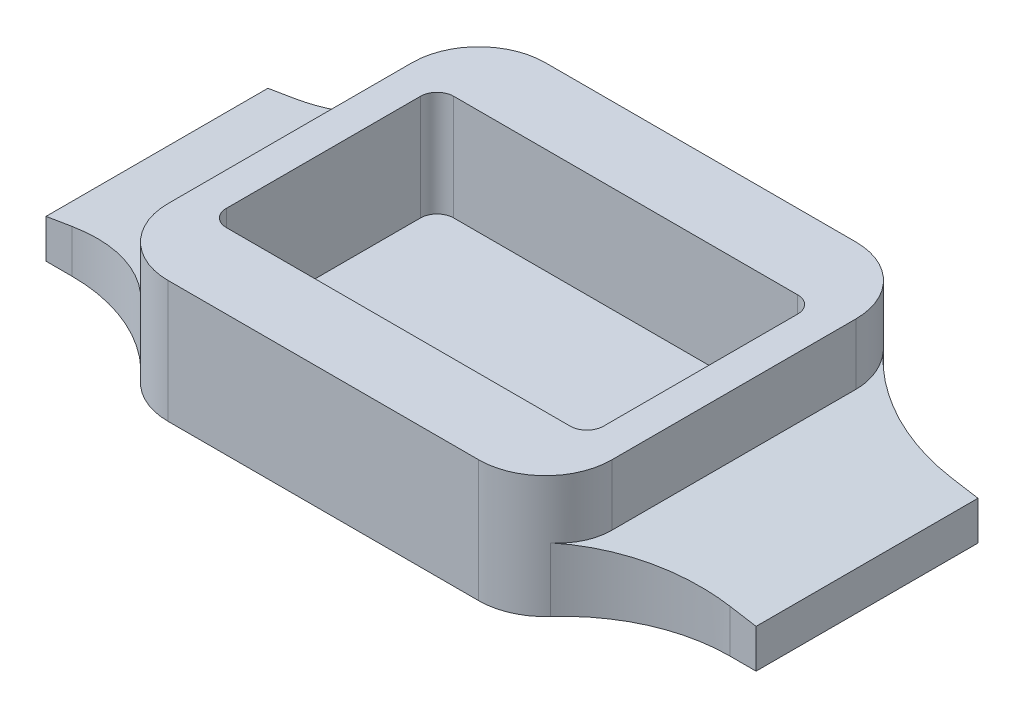
ISO-10303-21;
HEADER;
FILE_DESCRIPTION(('STEP AP214'),'2;1');
FILE_NAME('part.step','',(''),(''),'','','');
FILE_SCHEMA(('AUTOMOTIVE_DESIGN { 1 0 10303 214 1 1 1 1 }'));
ENDSEC;
DATA;
#1=APPLICATION_CONTEXT('core data for automotive mechanical design processes');
#2=APPLICATION_PROTOCOL_DEFINITION('international standard','automotive_design',2000,#1);
#3=PRODUCT_CONTEXT('',#1,'mechanical');
#4=PRODUCT('Part','Part','',(#3));
#5=PRODUCT_RELATED_PRODUCT_CATEGORY('part','',(#4));
#6=PRODUCT_DEFINITION_FORMATION('','',#4);
#7=PRODUCT_DEFINITION_CONTEXT('part definition',#1,'design');
#8=PRODUCT_DEFINITION('design','',#6,#7);
#9=PRODUCT_DEFINITION_SHAPE('','',#8);
#10=(LENGTH_UNIT() NAMED_UNIT(*) SI_UNIT(.MILLI.,.METRE.));
#11=(NAMED_UNIT(*) PLANE_ANGLE_UNIT() SI_UNIT($,.RADIAN.));
#12=(NAMED_UNIT(*) SI_UNIT($,.STERADIAN.) SOLID_ANGLE_UNIT());
#13=UNCERTAINTY_MEASURE_WITH_UNIT(LENGTH_MEASURE(1.E-05),#10,'distance_accuracy_value','');
#14=(GEOMETRIC_REPRESENTATION_CONTEXT(3) GLOBAL_UNCERTAINTY_ASSIGNED_CONTEXT((#13)) GLOBAL_UNIT_ASSIGNED_CONTEXT((#10,
#11,#12)) REPRESENTATION_CONTEXT('',''));
#15=CARTESIAN_POINT('',(0.,0.,0.));
#16=DIRECTION('',(0.,0.,1.));
#17=DIRECTION('',(1.,0.,0.));
#18=AXIS2_PLACEMENT_3D('',#15,#16,#17);
#19=CARTESIAN_POINT('',(0.,11.,0.));
#20=DIRECTION('',(1.,0.,0.));
#21=DIRECTION('',(0.,0.,-1.));
#22=AXIS2_PLACEMENT_3D('',#19,#20,#21);
#23=PLANE('',#22);
#24=DIRECTION('',(0.,-1.,0.));
#25=VECTOR('',#24,1.);
#26=CARTESIAN_POINT('',(0.,11.,-28.));
#27=LINE('',#26,#25);
#28=CARTESIAN_POINT('',(0.,11.,-28.));
#29=VERTEX_POINT('',#28);
#30=CARTESIAN_POINT('',(0.,5.5,-28.));
#31=VERTEX_POINT('',#30);
#32=EDGE_CURVE('E466',#29,#31,#27,.T.);
#33=ORIENTED_EDGE('',*,*,#32,.T.);
#34=DIRECTION('',(0.,0.,1.));
#35=VECTOR('',#34,1.);
#36=CARTESIAN_POINT('',(0.,5.5,-27.));
#37=LINE('',#36,#35);
#38=CARTESIAN_POINT('',(0.,5.5,-6.));
#39=VERTEX_POINT('',#38);
#40=EDGE_CURVE('E75',#31,#39,#37,.T.);
#41=ORIENTED_EDGE('',*,*,#40,.T.);
#42=DIRECTION('',(0.,-1.,0.));
#43=VECTOR('',#42,1.);
#44=CARTESIAN_POINT('',(0.,11.,-6.));
#45=LINE('',#44,#43);
#46=CARTESIAN_POINT('',(0.,11.,-6.));
#47=VERTEX_POINT('',#46);
#48=EDGE_CURVE('E463',#39,#47,#45,.F.);
#49=ORIENTED_EDGE('',*,*,#48,.T.);
#50=DIRECTION('',(0.,0.,1.));
#51=VECTOR('',#50,1.);
#52=CARTESIAN_POINT('',(0.,11.,0.));
#53=LINE('',#52,#51);
#54=EDGE_CURVE('E350',#29,#47,#53,.T.);
#55=ORIENTED_EDGE('',*,*,#54,.F.);
#56=EDGE_LOOP('',(#33,#41,#49,#55));
#57=FACE_BOUND('',#56,.T.);
#58=ADVANCED_FACE('F51',(#57),#23,.F.);
#59=CARTESIAN_POINT('',(0.,11.,0.));
#60=DIRECTION('',(0.,0.,-1.));
#61=DIRECTION('',(-1.,0.,0.));
#62=AXIS2_PLACEMENT_3D('',#59,#60,#61);
#63=PLANE('',#62);
#64=DIRECTION('',(1.,0.,0.));
#65=VECTOR('',#64,1.);
#66=CARTESIAN_POINT('',(0.,0.,0.));
#67=LINE('',#66,#65);
#68=CARTESIAN_POINT('',(6.,0.,0.));
#69=VERTEX_POINT('',#68);
#70=CARTESIAN_POINT('',(34.,0.,0.));
#71=VERTEX_POINT('',#70);
#72=EDGE_CURVE('E342',#69,#71,#67,.T.);
#73=ORIENTED_EDGE('',*,*,#72,.T.);
#74=DIRECTION('',(0.,-1.,0.));
#75=VECTOR('',#74,1.);
#76=CARTESIAN_POINT('',(34.,11.,0.));
#77=LINE('',#76,#75);
#78=CARTESIAN_POINT('',(34.,11.,0.));
#79=VERTEX_POINT('',#78);
#80=EDGE_CURVE('E473',#71,#79,#77,.F.);
#81=ORIENTED_EDGE('',*,*,#80,.T.);
#82=DIRECTION('',(1.,0.,0.));
#83=VECTOR('',#82,1.);
#84=CARTESIAN_POINT('',(0.,11.,0.));
#85=LINE('',#84,#83);
#86=CARTESIAN_POINT('',(6.,11.,0.));
#87=VERTEX_POINT('',#86);
#88=EDGE_CURVE('E354',#87,#79,#85,.T.);
#89=ORIENTED_EDGE('',*,*,#88,.F.);
#90=DIRECTION('',(0.,-1.,0.));
#91=VECTOR('',#90,1.);
#92=CARTESIAN_POINT('',(6.,11.,0.));
#93=LINE('',#92,#91);
#94=EDGE_CURVE('E469',#87,#69,#93,.T.);
#95=ORIENTED_EDGE('',*,*,#94,.T.);
#96=EDGE_LOOP('',(#73,#81,#89,#95));
#97=FACE_BOUND('',#96,.T.);
#98=ADVANCED_FACE('F577',(#97),#63,.F.);
#99=CARTESIAN_POINT('',(40.,11.,0.));
#100=DIRECTION('',(-1.,0.,0.));
#101=DIRECTION('',(0.,0.,1.));
#102=AXIS2_PLACEMENT_3D('',#99,#100,#101);
#103=PLANE('',#102);
#104=DIRECTION('',(0.,-1.,0.));
#105=VECTOR('',#104,1.);
#106=CARTESIAN_POINT('',(40.,11.,-6.));
#107=LINE('',#106,#105);
#108=CARTESIAN_POINT('',(40.,11.,-6.));
#109=VERTEX_POINT('',#108);
#110=CARTESIAN_POINT('',(40.,5.5,-6.));
#111=VERTEX_POINT('',#110);
#112=EDGE_CURVE('E445',#109,#111,#107,.T.);
#113=ORIENTED_EDGE('',*,*,#112,.T.);
#114=DIRECTION('',(0.,0.,1.));
#115=VECTOR('',#114,1.);
#116=CARTESIAN_POINT('',(40.,5.5,-27.));
#117=LINE('',#116,#115);
#118=CARTESIAN_POINT('',(40.,5.5,-28.));
#119=VERTEX_POINT('',#118);
#120=EDGE_CURVE('E67',#119,#111,#117,.T.);
#121=ORIENTED_EDGE('',*,*,#120,.F.);
#122=DIRECTION('',(0.,-1.,0.));
#123=VECTOR('',#122,1.);
#124=CARTESIAN_POINT('',(40.,11.,-28.));
#125=LINE('',#124,#123);
#126=CARTESIAN_POINT('',(40.,11.,-28.));
#127=VERTEX_POINT('',#126);
#128=EDGE_CURVE('E448',#119,#127,#125,.F.);
#129=ORIENTED_EDGE('',*,*,#128,.T.);
#130=DIRECTION('',(0.,0.,-1.));
#131=VECTOR('',#130,1.);
#132=CARTESIAN_POINT('',(40.,11.,0.));
#133=LINE('',#132,#131);
#134=EDGE_CURVE('E359',#109,#127,#133,.T.);
#135=ORIENTED_EDGE('',*,*,#134,.F.);
#136=EDGE_LOOP('',(#113,#121,#129,#135));
#137=FACE_BOUND('',#136,.T.);
#138=ADVANCED_FACE('F623',(#137),#103,.F.);
#139=CARTESIAN_POINT('',(0.,11.,-34.));
#140=DIRECTION('',(0.,0.,1.));
#141=DIRECTION('',(1.,0.,0.));
#142=AXIS2_PLACEMENT_3D('',#139,#140,#141);
#143=PLANE('',#142);
#144=DIRECTION('',(-1.,0.,0.));
#145=VECTOR('',#144,1.);
#146=CARTESIAN_POINT('',(0.,11.,-34.));
#147=LINE('',#146,#145);
#148=CARTESIAN_POINT('',(34.,11.,-34.));
#149=VERTEX_POINT('',#148);
#150=CARTESIAN_POINT('',(6.,11.,-34.));
#151=VERTEX_POINT('',#150);
#152=EDGE_CURVE('E363',#149,#151,#147,.T.);
#153=ORIENTED_EDGE('',*,*,#152,.F.);
#154=DIRECTION('',(0.,-1.,0.));
#155=VECTOR('',#154,1.);
#156=CARTESIAN_POINT('',(34.,11.,-34.));
#157=LINE('',#156,#155);
#158=CARTESIAN_POINT('',(34.,0.,-34.));
#159=VERTEX_POINT('',#158);
#160=EDGE_CURVE('E428',#149,#159,#157,.T.);
#161=ORIENTED_EDGE('',*,*,#160,.T.);
#162=DIRECTION('',(-1.,0.,0.));
#163=VECTOR('',#162,1.);
#164=CARTESIAN_POINT('',(0.,0.,-34.));
#165=LINE('',#164,#163);
#166=CARTESIAN_POINT('',(6.,0.,-34.));
#167=VERTEX_POINT('',#166);
#168=EDGE_CURVE('E355',#159,#167,#165,.T.);
#169=ORIENTED_EDGE('',*,*,#168,.T.);
#170=DIRECTION('',(0.,-1.,0.));
#171=VECTOR('',#170,1.);
#172=CARTESIAN_POINT('',(6.,11.,-34.));
#173=LINE('',#172,#171);
#174=EDGE_CURVE('E425',#167,#151,#173,.F.);
#175=ORIENTED_EDGE('',*,*,#174,.T.);
#176=EDGE_LOOP('',(#153,#161,#169,#175));
#177=FACE_BOUND('',#176,.T.);
#178=ADVANCED_FACE('F831',(#177),#143,.F.);
#179=CARTESIAN_POINT('',(0.,11.,0.));
#180=DIRECTION('',(0.,-1.,0.));
#181=DIRECTION('',(0.,0.,-1.));
#182=AXIS2_PLACEMENT_3D('',#179,#180,#181);
#183=PLANE('',#182);
#184=DIRECTION('',(0.,0.,1.));
#185=VECTOR('',#184,1.);
#186=CARTESIAN_POINT('',(3.,11.,-6.75));
#187=LINE('',#186,#185);
#188=CARTESIAN_POINT('',(3.,11.,-25.75));
#189=VERTEX_POINT('',#188);
#190=CARTESIAN_POINT('',(3.,11.,-8.25));
#191=VERTEX_POINT('',#190);
#192=EDGE_CURVE('E323',#189,#191,#187,.T.);
#193=ORIENTED_EDGE('',*,*,#192,.F.);
#194=CARTESIAN_POINT('',(4.5,11.,-25.75));
#195=DIRECTION('',(0.,-1.,0.));
#196=DIRECTION('',(0.,0.,-1.));
#197=AXIS2_PLACEMENT_3D('',#194,#195,#196);
#198=CIRCLE('',#197,1.5);
#199=CARTESIAN_POINT('',(4.5,11.,-27.25));
#200=VERTEX_POINT('',#199);
#201=EDGE_CURVE('E416',#189,#200,#198,.T.);
#202=ORIENTED_EDGE('',*,*,#201,.T.);
#203=DIRECTION('',(-1.,0.,0.));
#204=VECTOR('',#203,1.);
#205=CARTESIAN_POINT('',(3.,11.,-27.25));
#206=LINE('',#205,#204);
#207=CARTESIAN_POINT('',(35.5,11.,-27.25));
#208=VERTEX_POINT('',#207);
#209=EDGE_CURVE('E327',#208,#200,#206,.T.);
#210=ORIENTED_EDGE('',*,*,#209,.F.);
#211=CARTESIAN_POINT('',(35.5,11.,-25.75));
#212=DIRECTION('',(0.,-1.,0.));
#213=DIRECTION('',(0.,0.,-1.));
#214=AXIS2_PLACEMENT_3D('',#211,#212,#213);
#215=CIRCLE('',#214,1.5);
#216=CARTESIAN_POINT('',(37.,11.,-25.75));
#217=VERTEX_POINT('',#216);
#218=EDGE_CURVE('E419',#208,#217,#215,.T.);
#219=ORIENTED_EDGE('',*,*,#218,.T.);
#220=DIRECTION('',(0.,0.,-1.));
#221=VECTOR('',#220,1.);
#222=CARTESIAN_POINT('',(37.,11.,-6.75));
#223=LINE('',#222,#221);
#224=CARTESIAN_POINT('',(37.,11.,-8.25));
#225=VERTEX_POINT('',#224);
#226=EDGE_CURVE('E317',#225,#217,#223,.T.);
#227=ORIENTED_EDGE('',*,*,#226,.F.);
#228=CARTESIAN_POINT('',(35.5,11.,-8.25));
#229=DIRECTION('',(0.,-1.,0.));
#230=DIRECTION('',(0.,0.,-1.));
#231=AXIS2_PLACEMENT_3D('',#228,#229,#230);
#232=CIRCLE('',#231,1.5);
#233=CARTESIAN_POINT('',(35.5,11.,-6.75));
#234=VERTEX_POINT('',#233);
#235=EDGE_CURVE('E422',#225,#234,#232,.T.);
#236=ORIENTED_EDGE('',*,*,#235,.T.);
#237=DIRECTION('',(1.,0.,0.));
#238=VECTOR('',#237,1.);
#239=CARTESIAN_POINT('',(3.,11.,-6.75));
#240=LINE('',#239,#238);
#241=CARTESIAN_POINT('',(4.5,11.,-6.75));
#242=VERTEX_POINT('',#241);
#243=EDGE_CURVE('E318',#242,#234,#240,.T.);
#244=ORIENTED_EDGE('',*,*,#243,.F.);
#245=CARTESIAN_POINT('',(4.5,11.,-8.25));
#246=DIRECTION('',(0.,-1.,0.));
#247=DIRECTION('',(0.,0.,-1.));
#248=AXIS2_PLACEMENT_3D('',#245,#246,#247);
#249=CIRCLE('',#248,1.5);
#250=EDGE_CURVE('E413',#242,#191,#249,.T.);
#251=ORIENTED_EDGE('',*,*,#250,.T.);
#252=EDGE_LOOP('',(#193,#202,#210,#219,#227,#236,#244,#251));
#253=FACE_BOUND('',#252,.T.);
#254=ORIENTED_EDGE('',*,*,#134,.T.);
#255=CARTESIAN_POINT('',(34.,11.,-28.));
#256=DIRECTION('',(0.,-1.,0.));
#257=DIRECTION('',(0.,0.,-1.));
#258=AXIS2_PLACEMENT_3D('',#255,#256,#257);
#259=CIRCLE('',#258,6.);
#260=EDGE_CURVE('E460',#127,#149,#259,.F.);
#261=ORIENTED_EDGE('',*,*,#260,.T.);
#262=ORIENTED_EDGE('',*,*,#152,.T.);
#263=CARTESIAN_POINT('',(6.,11.,-28.));
#264=DIRECTION('',(0.,-1.,0.));
#265=DIRECTION('',(0.,0.,-1.));
#266=AXIS2_PLACEMENT_3D('',#263,#264,#265);
#267=CIRCLE('',#266,6.);
#268=EDGE_CURVE('E457',#151,#29,#267,.F.);
#269=ORIENTED_EDGE('',*,*,#268,.T.);
#270=ORIENTED_EDGE('',*,*,#54,.T.);
#271=CARTESIAN_POINT('',(6.,11.,-6.));
#272=DIRECTION('',(0.,-1.,0.));
#273=DIRECTION('',(0.,0.,-1.));
#274=AXIS2_PLACEMENT_3D('',#271,#272,#273);
#275=CIRCLE('',#274,6.);
#276=EDGE_CURVE('E451',#47,#87,#275,.F.);
#277=ORIENTED_EDGE('',*,*,#276,.T.);
#278=ORIENTED_EDGE('',*,*,#88,.T.);
#279=CARTESIAN_POINT('',(34.,11.,-6.));
#280=DIRECTION('',(0.,-1.,0.));
#281=DIRECTION('',(0.,0.,-1.));
#282=AXIS2_PLACEMENT_3D('',#279,#280,#281);
#283=CIRCLE('',#282,6.);
#284=EDGE_CURVE('E454',#79,#109,#283,.F.);
#285=ORIENTED_EDGE('',*,*,#284,.T.);
#286=EDGE_LOOP('',(#254,#261,#262,#269,#270,#277,#278,#285));
#287=FACE_BOUND('',#286,.T.);
#288=ADVANCED_FACE('F580',(#253,#287),#183,.F.);
#289=CARTESIAN_POINT('',(0.,0.,0.));
#290=DIRECTION('',(0.,-1.,0.));
#291=DIRECTION('',(0.,0.,-1.));
#292=AXIS2_PLACEMENT_3D('',#289,#290,#291);
#293=PLANE('',#292);
#294=ORIENTED_EDGE('',*,*,#168,.F.);
#295=CARTESIAN_POINT('',(34.,0.,-28.));
#296=DIRECTION('',(0.,-1.,0.));
#297=DIRECTION('',(0.,0.,-1.));
#298=AXIS2_PLACEMENT_3D('',#295,#296,#297);
#299=CIRCLE('',#298,6.);
#300=CARTESIAN_POINT('',(38.4721359549996,0.,-32.));
#301=VERTEX_POINT('',#300);
#302=EDGE_CURVE('E441',#159,#301,#299,.T.);
#303=ORIENTED_EDGE('',*,*,#302,.T.);
#304=CARTESIAN_POINT('',(49.6524758424985,0.,-42.));
#305=DIRECTION('',(0.,-1.,0.));
#306=DIRECTION('',(0.,0.,-1.));
#307=AXIS2_PLACEMENT_3D('',#304,#305,#306);
#308=CIRCLE('',#307,15.);
#309=CARTESIAN_POINT('',(49.6524758424985,0.,-27.));
#310=VERTEX_POINT('',#309);
#311=EDGE_CURVE('E12',#301,#310,#308,.F.);
#312=ORIENTED_EDGE('',*,*,#311,.T.);
#313=DIRECTION('',(-1.,0.,0.));
#314=VECTOR('',#313,1.);
#315=CARTESIAN_POINT('',(40.,0.,-27.));
#316=LINE('',#315,#314);
#317=CARTESIAN_POINT('',(52.,0.,-27.));
#318=VERTEX_POINT('',#317);
#319=EDGE_CURVE('E298',#318,#310,#316,.T.);
#320=ORIENTED_EDGE('',*,*,#319,.F.);
#321=DIRECTION('',(0.,0.,1.));
#322=VECTOR('',#321,1.);
#323=CARTESIAN_POINT('',(52.,0.,-27.));
#324=LINE('',#323,#322);
#325=CARTESIAN_POINT('',(52.,0.,-7.));
#326=VERTEX_POINT('',#325);
#327=EDGE_CURVE('E301',#318,#326,#324,.T.);
#328=ORIENTED_EDGE('',*,*,#327,.T.);
#329=DIRECTION('',(-1.,0.,0.));
#330=VECTOR('',#329,1.);
#331=CARTESIAN_POINT('',(40.,0.,-7.));
#332=LINE('',#331,#330);
#333=CARTESIAN_POINT('',(49.6524758424985,0.,-7.));
#334=VERTEX_POINT('',#333);
#335=EDGE_CURVE('E295',#326,#334,#332,.T.);
#336=ORIENTED_EDGE('',*,*,#335,.T.);
#337=CARTESIAN_POINT('',(49.6524758424985,0.,8.));
#338=DIRECTION('',(0.,-1.,0.));
#339=DIRECTION('',(0.,0.,-1.));
#340=AXIS2_PLACEMENT_3D('',#337,#338,#339);
#341=CIRCLE('',#340,15.);
#342=CARTESIAN_POINT('',(38.4721359549996,0.,-2.));
#343=VERTEX_POINT('',#342);
#344=EDGE_CURVE('E535',#334,#343,#341,.F.);
#345=ORIENTED_EDGE('',*,*,#344,.T.);
#346=CARTESIAN_POINT('',(34.,0.,-6.));
#347=DIRECTION('',(0.,-1.,0.));
#348=DIRECTION('',(0.,0.,-1.));
#349=AXIS2_PLACEMENT_3D('',#346,#347,#348);
#350=CIRCLE('',#349,6.);
#351=EDGE_CURVE('E435',#343,#71,#350,.T.);
#352=ORIENTED_EDGE('',*,*,#351,.T.);
#353=ORIENTED_EDGE('',*,*,#72,.F.);
#354=CARTESIAN_POINT('',(6.,0.,-6.));
#355=DIRECTION('',(0.,-1.,0.));
#356=DIRECTION('',(0.,0.,-1.));
#357=AXIS2_PLACEMENT_3D('',#354,#355,#356);
#358=CIRCLE('',#357,6.);
#359=CARTESIAN_POINT('',(1.52786404500042,0.,-2.));
#360=VERTEX_POINT('',#359);
#361=EDGE_CURVE('E432',#69,#360,#358,.T.);
#362=ORIENTED_EDGE('',*,*,#361,.T.);
#363=CARTESIAN_POINT('',(-9.65247584249853,0.,8.));
#364=DIRECTION('',(0.,-1.,0.));
#365=DIRECTION('',(0.,0.,-1.));
#366=AXIS2_PLACEMENT_3D('',#363,#364,#365);
#367=CIRCLE('',#366,15.);
#368=CARTESIAN_POINT('',(-9.65247584249853,0.,-7.));
#369=VERTEX_POINT('',#368);
#370=EDGE_CURVE('E254',#360,#369,#367,.F.);
#371=ORIENTED_EDGE('',*,*,#370,.T.);
#372=DIRECTION('',(-1.,0.,0.));
#373=VECTOR('',#372,1.);
#374=CARTESIAN_POINT('',(0.,0.,-7.));
#375=LINE('',#374,#373);
#376=CARTESIAN_POINT('',(-12.,0.,-7.));
#377=VERTEX_POINT('',#376);
#378=EDGE_CURVE('E246',#369,#377,#375,.T.);
#379=ORIENTED_EDGE('',*,*,#378,.T.);
#380=DIRECTION('',(0.,0.,1.));
#381=VECTOR('',#380,1.);
#382=CARTESIAN_POINT('',(-12.,0.,-27.));
#383=LINE('',#382,#381);
#384=CARTESIAN_POINT('',(-12.,0.,-27.));
#385=VERTEX_POINT('',#384);
#386=EDGE_CURVE('E251',#385,#377,#383,.T.);
#387=ORIENTED_EDGE('',*,*,#386,.F.);
#388=DIRECTION('',(-1.,0.,0.));
#389=VECTOR('',#388,1.);
#390=CARTESIAN_POINT('',(0.,0.,-27.));
#391=LINE('',#390,#389);
#392=CARTESIAN_POINT('',(-9.65247584249853,0.,-27.));
#393=VERTEX_POINT('',#392);
#394=EDGE_CURVE('E269',#393,#385,#391,.T.);
#395=ORIENTED_EDGE('',*,*,#394,.F.);
#396=CARTESIAN_POINT('',(-9.65247584249853,0.,-42.));
#397=DIRECTION('',(0.,-1.,0.));
#398=DIRECTION('',(0.,0.,-1.));
#399=AXIS2_PLACEMENT_3D('',#396,#397,#398);
#400=CIRCLE('',#399,15.);
#401=CARTESIAN_POINT('',(1.52786404500042,0.,-32.));
#402=VERTEX_POINT('',#401);
#403=EDGE_CURVE('E521',#393,#402,#400,.F.);
#404=ORIENTED_EDGE('',*,*,#403,.T.);
#405=CARTESIAN_POINT('',(6.,0.,-28.));
#406=DIRECTION('',(0.,-1.,0.));
#407=DIRECTION('',(0.,0.,-1.));
#408=AXIS2_PLACEMENT_3D('',#405,#406,#407);
#409=CIRCLE('',#408,6.);
#410=EDGE_CURVE('E438',#402,#167,#409,.T.);
#411=ORIENTED_EDGE('',*,*,#410,.T.);
#412=EDGE_LOOP('',(#294,#303,#312,#320,#328,#336,#345,#352,#353,#362,#371,#379,#387,#395,#404,#411));
#413=FACE_BOUND('',#412,.T.);
#414=ADVANCED_FACE('F249',(#413),#293,.T.);
#415=CARTESIAN_POINT('',(0.,1.5,0.));
#416=DIRECTION('',(0.,-1.,0.));
#417=DIRECTION('',(0.,0.,-1.));
#418=AXIS2_PLACEMENT_3D('',#415,#416,#417);
#419=PLANE('',#418);
#420=DIRECTION('',(0.,0.,1.));
#421=VECTOR('',#420,1.);
#422=CARTESIAN_POINT('',(3.,1.5,-6.75));
#423=LINE('',#422,#421);
#424=CARTESIAN_POINT('',(3.,1.5,-25.75));
#425=VERTEX_POINT('',#424);
#426=CARTESIAN_POINT('',(3.,1.5,-8.25));
#427=VERTEX_POINT('',#426);
#428=EDGE_CURVE('E337',#425,#427,#423,.T.);
#429=ORIENTED_EDGE('',*,*,#428,.T.);
#430=CARTESIAN_POINT('',(4.5,1.5,-8.25));
#431=DIRECTION('',(0.,-1.,0.));
#432=DIRECTION('',(0.,0.,-1.));
#433=AXIS2_PLACEMENT_3D('',#430,#431,#432);
#434=CIRCLE('',#433,1.5);
#435=CARTESIAN_POINT('',(4.5,1.5,-6.75));
#436=VERTEX_POINT('',#435);
#437=EDGE_CURVE('E396',#427,#436,#434,.F.);
#438=ORIENTED_EDGE('',*,*,#437,.T.);
#439=DIRECTION('',(1.,0.,0.));
#440=VECTOR('',#439,1.);
#441=CARTESIAN_POINT('',(3.,1.5,-6.75));
#442=LINE('',#441,#440);
#443=CARTESIAN_POINT('',(35.5,1.5,-6.75));
#444=VERTEX_POINT('',#443);
#445=EDGE_CURVE('E343',#436,#444,#442,.T.);
#446=ORIENTED_EDGE('',*,*,#445,.T.);
#447=CARTESIAN_POINT('',(35.5,1.5,-8.25));
#448=DIRECTION('',(0.,-1.,0.));
#449=DIRECTION('',(0.,0.,-1.));
#450=AXIS2_PLACEMENT_3D('',#447,#448,#449);
#451=CIRCLE('',#450,1.5);
#452=CARTESIAN_POINT('',(37.,1.5,-8.25));
#453=VERTEX_POINT('',#452);
#454=EDGE_CURVE('E387',#444,#453,#451,.F.);
#455=ORIENTED_EDGE('',*,*,#454,.T.);
#456=DIRECTION('',(0.,0.,-1.));
#457=VECTOR('',#456,1.);
#458=CARTESIAN_POINT('',(37.,1.5,-6.75));
#459=LINE('',#458,#457);
#460=CARTESIAN_POINT('',(37.,1.5,-25.75));
#461=VERTEX_POINT('',#460);
#462=EDGE_CURVE('E338',#453,#461,#459,.T.);
#463=ORIENTED_EDGE('',*,*,#462,.T.);
#464=CARTESIAN_POINT('',(35.5,1.5,-25.75));
#465=DIRECTION('',(0.,-1.,0.));
#466=DIRECTION('',(0.,0.,-1.));
#467=AXIS2_PLACEMENT_3D('',#464,#465,#466);
#468=CIRCLE('',#467,1.5);
#469=CARTESIAN_POINT('',(35.5,1.5,-27.25));
#470=VERTEX_POINT('',#469);
#471=EDGE_CURVE('E390',#461,#470,#468,.F.);
#472=ORIENTED_EDGE('',*,*,#471,.T.);
#473=DIRECTION('',(-1.,0.,0.));
#474=VECTOR('',#473,1.);
#475=CARTESIAN_POINT('',(3.,1.5,-27.25));
#476=LINE('',#475,#474);
#477=CARTESIAN_POINT('',(4.5,1.5,-27.25));
#478=VERTEX_POINT('',#477);
#479=EDGE_CURVE('E322',#470,#478,#476,.T.);
#480=ORIENTED_EDGE('',*,*,#479,.T.);
#481=CARTESIAN_POINT('',(4.5,1.5,-25.75));
#482=DIRECTION('',(0.,-1.,0.));
#483=DIRECTION('',(0.,0.,-1.));
#484=AXIS2_PLACEMENT_3D('',#481,#482,#483);
#485=CIRCLE('',#484,1.5);
#486=EDGE_CURVE('E393',#478,#425,#485,.F.);
#487=ORIENTED_EDGE('',*,*,#486,.T.);
#488=EDGE_LOOP('',(#429,#438,#446,#455,#463,#472,#480,#487));
#489=FACE_BOUND('',#488,.T.);
#490=ADVANCED_FACE('F815',(#489),#419,.F.);
#491=CARTESIAN_POINT('',(3.,-39.7020150622106,-27.25));
#492=DIRECTION('',(0.,0.,-1.));
#493=DIRECTION('',(-1.,0.,0.));
#494=AXIS2_PLACEMENT_3D('',#491,#492,#493);
#495=PLANE('',#494);
#496=ORIENTED_EDGE('',*,*,#209,.T.);
#497=DIRECTION('',(0.,1.,0.));
#498=VECTOR('',#497,1.);
#499=CARTESIAN_POINT('',(4.5,1.5,-27.25));
#500=LINE('',#499,#498);
#501=EDGE_CURVE('E403',#200,#478,#500,.F.);
#502=ORIENTED_EDGE('',*,*,#501,.T.);
#503=ORIENTED_EDGE('',*,*,#479,.F.);
#504=DIRECTION('',(0.,1.,0.));
#505=VECTOR('',#504,1.);
#506=CARTESIAN_POINT('',(35.5,11.,-27.25));
#507=LINE('',#506,#505);
#508=EDGE_CURVE('E399',#470,#208,#507,.T.);
#509=ORIENTED_EDGE('',*,*,#508,.T.);
#510=EDGE_LOOP('',(#496,#502,#503,#509));
#511=FACE_BOUND('',#510,.T.);
#512=ADVANCED_FACE('F882',(#511),#495,.F.);
#513=CARTESIAN_POINT('',(3.,-39.7020150622106,-6.75));
#514=DIRECTION('',(-1.,0.,0.));
#515=DIRECTION('',(0.,0.,1.));
#516=AXIS2_PLACEMENT_3D('',#513,#514,#515);
#517=PLANE('',#516);
#518=ORIENTED_EDGE('',*,*,#192,.T.);
#519=DIRECTION('',(0.,1.,0.));
#520=VECTOR('',#519,1.);
#521=CARTESIAN_POINT('',(3.,1.5,-8.25));
#522=LINE('',#521,#520);
#523=EDGE_CURVE('E384',#191,#427,#522,.F.);
#524=ORIENTED_EDGE('',*,*,#523,.T.);
#525=ORIENTED_EDGE('',*,*,#428,.F.);
#526=DIRECTION('',(0.,1.,0.));
#527=VECTOR('',#526,1.);
#528=CARTESIAN_POINT('',(3.,11.,-25.75));
#529=LINE('',#528,#527);
#530=EDGE_CURVE('E380',#425,#189,#529,.T.);
#531=ORIENTED_EDGE('',*,*,#530,.T.);
#532=EDGE_LOOP('',(#518,#524,#525,#531));
#533=FACE_BOUND('',#532,.T.);
#534=ADVANCED_FACE('F890',(#533),#517,.F.);
#535=CARTESIAN_POINT('',(3.,-39.7020150622106,-6.75));
#536=DIRECTION('',(0.,0.,1.));
#537=DIRECTION('',(1.,0.,0.));
#538=AXIS2_PLACEMENT_3D('',#535,#536,#537);
#539=PLANE('',#538);
#540=ORIENTED_EDGE('',*,*,#445,.F.);
#541=DIRECTION('',(0.,1.,0.));
#542=VECTOR('',#541,1.);
#543=CARTESIAN_POINT('',(4.5,11.,-6.75));
#544=LINE('',#543,#542);
#545=EDGE_CURVE('E376',#436,#242,#544,.T.);
#546=ORIENTED_EDGE('',*,*,#545,.T.);
#547=ORIENTED_EDGE('',*,*,#243,.T.);
#548=DIRECTION('',(0.,1.,0.));
#549=VECTOR('',#548,1.);
#550=CARTESIAN_POINT('',(35.5,1.5,-6.75));
#551=LINE('',#550,#549);
#552=EDGE_CURVE('E367',#234,#444,#551,.F.);
#553=ORIENTED_EDGE('',*,*,#552,.T.);
#554=EDGE_LOOP('',(#540,#546,#547,#553));
#555=FACE_BOUND('',#554,.T.);
#556=ADVANCED_FACE('F898',(#555),#539,.F.);
#557=CARTESIAN_POINT('',(37.,-39.7020150622106,-6.75));
#558=DIRECTION('',(1.,0.,0.));
#559=DIRECTION('',(0.,0.,-1.));
#560=AXIS2_PLACEMENT_3D('',#557,#558,#559);
#561=PLANE('',#560);
#562=ORIENTED_EDGE('',*,*,#226,.T.);
#563=DIRECTION('',(0.,1.,0.));
#564=VECTOR('',#563,1.);
#565=CARTESIAN_POINT('',(37.,1.5,-25.75));
#566=LINE('',#565,#564);
#567=EDGE_CURVE('E410',#217,#461,#566,.F.);
#568=ORIENTED_EDGE('',*,*,#567,.T.);
#569=ORIENTED_EDGE('',*,*,#462,.F.);
#570=DIRECTION('',(0.,1.,0.));
#571=VECTOR('',#570,1.);
#572=CARTESIAN_POINT('',(37.,11.,-8.25));
#573=LINE('',#572,#571);
#574=EDGE_CURVE('E406',#453,#225,#573,.T.);
#575=ORIENTED_EDGE('',*,*,#574,.T.);
#576=EDGE_LOOP('',(#562,#568,#569,#575));
#577=FACE_BOUND('',#576,.T.);
#578=ADVANCED_FACE('F631',(#577),#561,.F.);
#579=CARTESIAN_POINT('',(4.5,-39.7020150622106,-8.25));
#580=DIRECTION('',(0.,-1.,0.));
#581=DIRECTION('',(0.,0.,-1.));
#582=AXIS2_PLACEMENT_3D('',#579,#580,#581);
#583=CYLINDRICAL_SURFACE('',#582,1.5);
#584=ORIENTED_EDGE('',*,*,#437,.F.);
#585=ORIENTED_EDGE('',*,*,#523,.F.);
#586=ORIENTED_EDGE('',*,*,#250,.F.);
#587=ORIENTED_EDGE('',*,*,#545,.F.);
#588=EDGE_LOOP('',(#584,#585,#586,#587));
#589=FACE_BOUND('',#588,.T.);
#590=ADVANCED_FACE('F627',(#589),#583,.F.);
#591=CARTESIAN_POINT('',(4.5,-39.7020150622106,-25.75));
#592=DIRECTION('',(0.,-1.,0.));
#593=DIRECTION('',(0.,0.,-1.));
#594=AXIS2_PLACEMENT_3D('',#591,#592,#593);
#595=CYLINDRICAL_SURFACE('',#594,1.5);
#596=ORIENTED_EDGE('',*,*,#486,.F.);
#597=ORIENTED_EDGE('',*,*,#501,.F.);
#598=ORIENTED_EDGE('',*,*,#201,.F.);
#599=ORIENTED_EDGE('',*,*,#530,.F.);
#600=EDGE_LOOP('',(#596,#597,#598,#599));
#601=FACE_BOUND('',#600,.T.);
#602=ADVANCED_FACE('F630',(#601),#595,.F.);
#603=CARTESIAN_POINT('',(35.5,-39.7020150622106,-25.75));
#604=DIRECTION('',(0.,-1.,0.));
#605=DIRECTION('',(0.,0.,-1.));
#606=AXIS2_PLACEMENT_3D('',#603,#604,#605);
#607=CYLINDRICAL_SURFACE('',#606,1.5);
#608=ORIENTED_EDGE('',*,*,#471,.F.);
#609=ORIENTED_EDGE('',*,*,#567,.F.);
#610=ORIENTED_EDGE('',*,*,#218,.F.);
#611=ORIENTED_EDGE('',*,*,#508,.F.);
#612=EDGE_LOOP('',(#608,#609,#610,#611));
#613=FACE_BOUND('',#612,.T.);
#614=ADVANCED_FACE('F635',(#613),#607,.F.);
#615=CARTESIAN_POINT('',(35.5,-39.7020150622106,-8.25));
#616=DIRECTION('',(0.,-1.,0.));
#617=DIRECTION('',(0.,0.,-1.));
#618=AXIS2_PLACEMENT_3D('',#615,#616,#617);
#619=CYLINDRICAL_SURFACE('',#618,1.5);
#620=ORIENTED_EDGE('',*,*,#454,.F.);
#621=ORIENTED_EDGE('',*,*,#552,.F.);
#622=ORIENTED_EDGE('',*,*,#235,.F.);
#623=ORIENTED_EDGE('',*,*,#574,.F.);
#624=EDGE_LOOP('',(#620,#621,#622,#623));
#625=FACE_BOUND('',#624,.T.);
#626=ADVANCED_FACE('F639',(#625),#619,.F.);
#627=CARTESIAN_POINT('',(52.,3.5,-27.));
#628=DIRECTION('',(-0.164398987305357,-0.986393923832144,0.));
#629=DIRECTION('',(0.986393923832144,-0.164398987305357,0.));
#630=AXIS2_PLACEMENT_3D('',#627,#628,#629);
#631=PLANE('',#630);
#632=ORIENTED_EDGE('',*,*,#120,.T.);
#633=CARTESIAN_POINT('',(34.,6.5,-6.));
#634=DIRECTION('',(-0.164398987305357,-0.986393923832144,0.));
#635=DIRECTION('',(0.986393923832144,-0.164398987305357,0.));
#636=AXIS2_PLACEMENT_3D('',#633,#634,#635);
#637=ELLIPSE('',#636,6.08276253029822,6.);
#638=CARTESIAN_POINT('',(38.4721359549996,5.75464400750007,-2.));
#639=VERTEX_POINT('',#638);
#640=EDGE_CURVE('E499',#639,#111,#637,.F.);
#641=ORIENTED_EDGE('',*,*,#640,.F.);
#642=CARTESIAN_POINT('',(49.6524758424985,3.89125402625024,8.));
#643=DIRECTION('',(-0.164398987305357,-0.986393923832144,0.));
#644=DIRECTION('',(0.986393923832144,-0.164398987305357,0.));
#645=AXIS2_PLACEMENT_3D('',#642,#643,#644);
#646=ELLIPSE('',#645,15.2069063257455,15.);
#647=CARTESIAN_POINT('',(49.6524758424985,3.89125402625024,-7.));
#648=VERTEX_POINT('',#647);
#649=EDGE_CURVE('E532',#639,#648,#646,.T.);
#650=ORIENTED_EDGE('',*,*,#649,.T.);
#651=DIRECTION('',(0.986393923832144,-0.164398987305357,0.));
#652=VECTOR('',#651,1.);
#653=CARTESIAN_POINT('',(52.,3.5,-7.));
#654=LINE('',#653,#652);
#655=CARTESIAN_POINT('',(52.,3.5,-7.));
#656=VERTEX_POINT('',#655);
#657=EDGE_CURVE('E275',#648,#656,#654,.T.);
#658=ORIENTED_EDGE('',*,*,#657,.T.);
#659=DIRECTION('',(0.,0.,1.));
#660=VECTOR('',#659,1.);
#661=CARTESIAN_POINT('',(52.,3.5,-27.));
#662=LINE('',#661,#660);
#663=CARTESIAN_POINT('',(52.,3.5,-27.));
#664=VERTEX_POINT('',#663);
#665=EDGE_CURVE('E311',#664,#656,#662,.T.);
#666=ORIENTED_EDGE('',*,*,#665,.F.);
#667=DIRECTION('',(0.986393923832144,-0.164398987305357,0.));
#668=VECTOR('',#667,1.);
#669=CARTESIAN_POINT('',(52.,3.5,-27.));
#670=LINE('',#669,#668);
#671=CARTESIAN_POINT('',(49.6524758424985,3.89125402625024,-27.));
#672=VERTEX_POINT('',#671);
#673=EDGE_CURVE('E291',#672,#664,#670,.T.);
#674=ORIENTED_EDGE('',*,*,#673,.F.);
#675=CARTESIAN_POINT('',(49.6524758424985,3.89125402625024,-42.));
#676=DIRECTION('',(-0.164398987305357,-0.986393923832144,0.));
#677=DIRECTION('',(0.986393923832144,-0.164398987305357,0.));
#678=AXIS2_PLACEMENT_3D('',#675,#676,#677);
#679=ELLIPSE('',#678,15.2069063257455,15.);
#680=CARTESIAN_POINT('',(38.4721359549996,5.75464400750007,-32.));
#681=VERTEX_POINT('',#680);
#682=EDGE_CURVE('E60',#672,#681,#679,.T.);
#683=ORIENTED_EDGE('',*,*,#682,.T.);
#684=CARTESIAN_POINT('',(34.,6.5,-28.));
#685=DIRECTION('',(-0.164398987305357,-0.986393923832144,0.));
#686=DIRECTION('',(0.986393923832144,-0.164398987305357,0.));
#687=AXIS2_PLACEMENT_3D('',#684,#685,#686);
#688=ELLIPSE('',#687,6.08276253029822,6.);
#689=EDGE_CURVE('E517',#119,#681,#688,.F.);
#690=ORIENTED_EDGE('',*,*,#689,.F.);
#691=EDGE_LOOP('',(#632,#641,#650,#658,#666,#674,#683,#690));
#692=FACE_BOUND('',#691,.T.);
#693=ADVANCED_FACE('F540',(#692),#631,.F.);
#694=CARTESIAN_POINT('',(52.,0.,-27.));
#695=DIRECTION('',(-1.,0.,0.));
#696=DIRECTION('',(0.,0.,1.));
#697=AXIS2_PLACEMENT_3D('',#694,#695,#696);
#698=PLANE('',#697);
#699=DIRECTION('',(0.,-1.,0.));
#700=VECTOR('',#699,1.);
#701=CARTESIAN_POINT('',(52.,0.,-7.));
#702=LINE('',#701,#700);
#703=EDGE_CURVE('E279',#656,#326,#702,.T.);
#704=ORIENTED_EDGE('',*,*,#703,.T.);
#705=ORIENTED_EDGE('',*,*,#327,.F.);
#706=DIRECTION('',(0.,-1.,0.));
#707=VECTOR('',#706,1.);
#708=CARTESIAN_POINT('',(52.,0.,-27.));
#709=LINE('',#708,#707);
#710=EDGE_CURVE('E294',#664,#318,#709,.T.);
#711=ORIENTED_EDGE('',*,*,#710,.F.);
#712=ORIENTED_EDGE('',*,*,#665,.T.);
#713=EDGE_LOOP('',(#704,#705,#711,#712));
#714=FACE_BOUND('',#713,.T.);
#715=ADVANCED_FACE('F556',(#714),#698,.F.);
#716=CARTESIAN_POINT('',(0.,0.,-27.));
#717=DIRECTION('',(0.,0.,1.));
#718=DIRECTION('',(1.,0.,0.));
#719=AXIS2_PLACEMENT_3D('',#716,#717,#718);
#720=PLANE('',#719);
#721=ORIENTED_EDGE('',*,*,#319,.T.);
#722=DIRECTION('',(0.,-1.,0.));
#723=VECTOR('',#722,1.);
#724=CARTESIAN_POINT('',(49.6524758424985,0.,-27.));
#725=LINE('',#724,#723);
#726=EDGE_CURVE('E510',#310,#672,#725,.F.);
#727=ORIENTED_EDGE('',*,*,#726,.T.);
#728=ORIENTED_EDGE('',*,*,#673,.T.);
#729=ORIENTED_EDGE('',*,*,#710,.T.);
#730=EDGE_LOOP('',(#721,#727,#728,#729));
#731=FACE_BOUND('',#730,.T.);
#732=ADVANCED_FACE('F552',(#731),#720,.F.);
#733=CARTESIAN_POINT('',(0.,0.,-7.));
#734=DIRECTION('',(0.,0.,1.));
#735=DIRECTION('',(1.,0.,0.));
#736=AXIS2_PLACEMENT_3D('',#733,#734,#735);
#737=PLANE('',#736);
#738=ORIENTED_EDGE('',*,*,#657,.F.);
#739=DIRECTION('',(0.,1.,0.));
#740=VECTOR('',#739,1.);
#741=CARTESIAN_POINT('',(49.6524758424985,0.,-7.));
#742=LINE('',#741,#740);
#743=EDGE_CURVE('E507',#648,#334,#742,.F.);
#744=ORIENTED_EDGE('',*,*,#743,.T.);
#745=ORIENTED_EDGE('',*,*,#335,.F.);
#746=ORIENTED_EDGE('',*,*,#703,.F.);
#747=EDGE_LOOP('',(#738,#744,#745,#746));
#748=FACE_BOUND('',#747,.T.);
#749=ADVANCED_FACE('F562',(#748),#737,.T.);
#750=CARTESIAN_POINT('',(-12.,0.,-27.));
#751=DIRECTION('',(1.,0.,0.));
#752=DIRECTION('',(0.,0.,-1.));
#753=AXIS2_PLACEMENT_3D('',#750,#751,#752);
#754=PLANE('',#753);
#755=DIRECTION('',(0.,1.,0.));
#756=VECTOR('',#755,1.);
#757=CARTESIAN_POINT('',(-12.,0.,-7.));
#758=LINE('',#757,#756);
#759=CARTESIAN_POINT('',(-12.,3.5,-7.));
#760=VERTEX_POINT('',#759);
#761=EDGE_CURVE('E266',#377,#760,#758,.T.);
#762=ORIENTED_EDGE('',*,*,#761,.T.);
#763=DIRECTION('',(0.,0.,1.));
#764=VECTOR('',#763,1.);
#765=CARTESIAN_POINT('',(-12.,3.5,-27.));
#766=LINE('',#765,#764);
#767=CARTESIAN_POINT('',(-12.,3.5,-27.));
#768=VERTEX_POINT('',#767);
#769=EDGE_CURVE('E593',#768,#760,#766,.T.);
#770=ORIENTED_EDGE('',*,*,#769,.F.);
#771=DIRECTION('',(0.,1.,0.));
#772=VECTOR('',#771,1.);
#773=CARTESIAN_POINT('',(-12.,0.,-27.));
#774=LINE('',#773,#772);
#775=EDGE_CURVE('E260',#385,#768,#774,.T.);
#776=ORIENTED_EDGE('',*,*,#775,.F.);
#777=ORIENTED_EDGE('',*,*,#386,.T.);
#778=EDGE_LOOP('',(#762,#770,#776,#777));
#779=FACE_BOUND('',#778,.T.);
#780=ADVANCED_FACE('F264',(#779),#754,.F.);
#781=CARTESIAN_POINT('',(-12.,3.5,-27.));
#782=DIRECTION('',(0.164398987305357,-0.986393923832144,0.));
#783=DIRECTION('',(0.986393923832144,0.164398987305357,0.));
#784=AXIS2_PLACEMENT_3D('',#781,#782,#783);
#785=PLANE('',#784);
#786=DIRECTION('',(0.986393923832144,0.164398987305357,0.));
#787=VECTOR('',#786,1.);
#788=CARTESIAN_POINT('',(-12.,3.5,-7.));
#789=LINE('',#788,#787);
#790=CARTESIAN_POINT('',(-9.65247584249853,3.89125402625024,-7.));
#791=VERTEX_POINT('',#790);
#792=EDGE_CURVE('E259',#760,#791,#789,.T.);
#793=ORIENTED_EDGE('',*,*,#792,.T.);
#794=CARTESIAN_POINT('',(-9.65247584249853,3.89125402625024,8.));
#795=DIRECTION('',(0.164398987305357,-0.986393923832144,0.));
#796=DIRECTION('',(-0.986393923832144,-0.164398987305357,0.));
#797=AXIS2_PLACEMENT_3D('',#794,#795,#796);
#798=ELLIPSE('',#797,15.2069063257455,15.);
#799=CARTESIAN_POINT('',(1.52786404500042,5.75464400750007,-2.));
#800=VERTEX_POINT('',#799);
#801=EDGE_CURVE('E529',#791,#800,#798,.T.);
#802=ORIENTED_EDGE('',*,*,#801,.T.);
#803=CARTESIAN_POINT('',(6.,6.5,-6.));
#804=DIRECTION('',(0.164398987305357,-0.986393923832144,0.));
#805=DIRECTION('',(-0.986393923832144,-0.164398987305357,0.));
#806=AXIS2_PLACEMENT_3D('',#803,#804,#805);
#807=ELLIPSE('',#806,6.08276253029822,6.);
#808=EDGE_CURVE('E488',#39,#800,#807,.F.);
#809=ORIENTED_EDGE('',*,*,#808,.F.);
#810=ORIENTED_EDGE('',*,*,#40,.F.);
#811=CARTESIAN_POINT('',(6.,6.5,-28.));
#812=DIRECTION('',(0.164398987305357,-0.986393923832144,0.));
#813=DIRECTION('',(-0.986393923832144,-0.164398987305357,0.));
#814=AXIS2_PLACEMENT_3D('',#811,#812,#813);
#815=ELLIPSE('',#814,6.08276253029822,6.);
#816=CARTESIAN_POINT('',(1.52786404500042,5.75464400750007,-32.));
#817=VERTEX_POINT('',#816);
#818=EDGE_CURVE('E480',#817,#31,#815,.F.);
#819=ORIENTED_EDGE('',*,*,#818,.F.);
#820=CARTESIAN_POINT('',(-9.65247584249853,3.89125402625024,-42.));
#821=DIRECTION('',(0.164398987305357,-0.986393923832144,0.));
#822=DIRECTION('',(-0.986393923832144,-0.164398987305357,0.));
#823=AXIS2_PLACEMENT_3D('',#820,#821,#822);
#824=ELLIPSE('',#823,15.2069063257455,15.);
#825=CARTESIAN_POINT('',(-9.65247584249853,3.89125402625024,-27.));
#826=VERTEX_POINT('',#825);
#827=EDGE_CURVE('E524',#817,#826,#824,.T.);
#828=ORIENTED_EDGE('',*,*,#827,.T.);
#829=DIRECTION('',(0.986393923832144,0.164398987305357,0.));
#830=VECTOR('',#829,1.);
#831=CARTESIAN_POINT('',(-12.,3.5,-27.));
#832=LINE('',#831,#830);
#833=EDGE_CURVE('E285',#768,#826,#832,.T.);
#834=ORIENTED_EDGE('',*,*,#833,.F.);
#835=ORIENTED_EDGE('',*,*,#769,.T.);
#836=EDGE_LOOP('',(#793,#802,#809,#810,#819,#828,#834,#835));
#837=FACE_BOUND('',#836,.T.);
#838=ADVANCED_FACE('F592',(#837),#785,.F.);
#839=CARTESIAN_POINT('',(0.,0.,-27.));
#840=DIRECTION('',(0.,0.,1.));
#841=DIRECTION('',(1.,0.,0.));
#842=AXIS2_PLACEMENT_3D('',#839,#840,#841);
#843=PLANE('',#842);
#844=ORIENTED_EDGE('',*,*,#833,.T.);
#845=DIRECTION('',(0.,-1.,0.));
#846=VECTOR('',#845,1.);
#847=CARTESIAN_POINT('',(-9.65247584249853,0.,-27.));
#848=LINE('',#847,#846);
#849=EDGE_CURVE('E476',#826,#393,#848,.T.);
#850=ORIENTED_EDGE('',*,*,#849,.T.);
#851=ORIENTED_EDGE('',*,*,#394,.T.);
#852=ORIENTED_EDGE('',*,*,#775,.T.);
#853=EDGE_LOOP('',(#844,#850,#851,#852));
#854=FACE_BOUND('',#853,.T.);
#855=ADVANCED_FACE('F601',(#854),#843,.F.);
#856=CARTESIAN_POINT('',(0.,0.,-7.));
#857=DIRECTION('',(0.,0.,1.));
#858=DIRECTION('',(1.,0.,0.));
#859=AXIS2_PLACEMENT_3D('',#856,#857,#858);
#860=PLANE('',#859);
#861=ORIENTED_EDGE('',*,*,#378,.F.);
#862=DIRECTION('',(0.,1.,0.));
#863=VECTOR('',#862,1.);
#864=CARTESIAN_POINT('',(-9.65247584249853,5.5,-7.));
#865=LINE('',#864,#863);
#866=EDGE_CURVE('E496',#369,#791,#865,.T.);
#867=ORIENTED_EDGE('',*,*,#866,.T.);
#868=ORIENTED_EDGE('',*,*,#792,.F.);
#869=ORIENTED_EDGE('',*,*,#761,.F.);
#870=EDGE_LOOP('',(#861,#867,#868,#869));
#871=FACE_BOUND('',#870,.T.);
#872=ADVANCED_FACE('F271',(#871),#860,.T.);
#873=CARTESIAN_POINT('',(34.,11.,-28.));
#874=DIRECTION('',(0.,-1.,0.));
#875=DIRECTION('',(0.,0.,-1.));
#876=AXIS2_PLACEMENT_3D('',#873,#874,#875);
#877=CYLINDRICAL_SURFACE('',#876,6.);
#878=ORIENTED_EDGE('',*,*,#128,.F.);
#879=ORIENTED_EDGE('',*,*,#689,.T.);
#880=DIRECTION('',(0.,-1.,0.));
#881=VECTOR('',#880,1.);
#882=CARTESIAN_POINT('',(38.4721359549996,11.,-32.));
#883=LINE('',#882,#881);
#884=EDGE_CURVE('E514',#681,#301,#883,.T.);
#885=ORIENTED_EDGE('',*,*,#884,.T.);
#886=ORIENTED_EDGE('',*,*,#302,.F.);
#887=ORIENTED_EDGE('',*,*,#160,.F.);
#888=ORIENTED_EDGE('',*,*,#260,.F.);
#889=EDGE_LOOP('',(#878,#879,#885,#886,#887,#888));
#890=FACE_BOUND('',#889,.T.);
#891=ADVANCED_FACE('F547',(#890),#877,.T.);
#892=CARTESIAN_POINT('',(6.,11.,-28.));
#893=DIRECTION('',(0.,-1.,0.));
#894=DIRECTION('',(0.,0.,-1.));
#895=AXIS2_PLACEMENT_3D('',#892,#893,#894);
#896=CYLINDRICAL_SURFACE('',#895,6.);
#897=ORIENTED_EDGE('',*,*,#410,.F.);
#898=DIRECTION('',(0.,-1.,0.));
#899=VECTOR('',#898,1.);
#900=CARTESIAN_POINT('',(1.52786404500042,11.,-32.));
#901=LINE('',#900,#899);
#902=EDGE_CURVE('E484',#402,#817,#901,.F.);
#903=ORIENTED_EDGE('',*,*,#902,.T.);
#904=ORIENTED_EDGE('',*,*,#818,.T.);
#905=ORIENTED_EDGE('',*,*,#32,.F.);
#906=ORIENTED_EDGE('',*,*,#268,.F.);
#907=ORIENTED_EDGE('',*,*,#174,.F.);
#908=EDGE_LOOP('',(#897,#903,#904,#905,#906,#907));
#909=FACE_BOUND('',#908,.T.);
#910=ADVANCED_FACE('F607',(#909),#896,.T.);
#911=CARTESIAN_POINT('',(34.,11.,-6.));
#912=DIRECTION('',(0.,-1.,0.));
#913=DIRECTION('',(0.,0.,-1.));
#914=AXIS2_PLACEMENT_3D('',#911,#912,#913);
#915=CYLINDRICAL_SURFACE('',#914,6.);
#916=ORIENTED_EDGE('',*,*,#351,.F.);
#917=DIRECTION('',(0.,-1.,0.));
#918=VECTOR('',#917,1.);
#919=CARTESIAN_POINT('',(38.4721359549996,11.,-2.));
#920=LINE('',#919,#918);
#921=EDGE_CURVE('E503',#343,#639,#920,.F.);
#922=ORIENTED_EDGE('',*,*,#921,.T.);
#923=ORIENTED_EDGE('',*,*,#640,.T.);
#924=ORIENTED_EDGE('',*,*,#112,.F.);
#925=ORIENTED_EDGE('',*,*,#284,.F.);
#926=ORIENTED_EDGE('',*,*,#80,.F.);
#927=EDGE_LOOP('',(#916,#922,#923,#924,#925,#926));
#928=FACE_BOUND('',#927,.T.);
#929=ADVANCED_FACE('F572',(#928),#915,.T.);
#930=CARTESIAN_POINT('',(6.,11.,-6.));
#931=DIRECTION('',(0.,-1.,0.));
#932=DIRECTION('',(0.,0.,-1.));
#933=AXIS2_PLACEMENT_3D('',#930,#931,#932);
#934=CYLINDRICAL_SURFACE('',#933,6.);
#935=ORIENTED_EDGE('',*,*,#808,.T.);
#936=DIRECTION('',(0.,-1.,0.));
#937=VECTOR('',#936,1.);
#938=CARTESIAN_POINT('',(1.52786404500042,11.,-2.));
#939=LINE('',#938,#937);
#940=EDGE_CURVE('E492',#800,#360,#939,.T.);
#941=ORIENTED_EDGE('',*,*,#940,.T.);
#942=ORIENTED_EDGE('',*,*,#361,.F.);
#943=ORIENTED_EDGE('',*,*,#94,.F.);
#944=ORIENTED_EDGE('',*,*,#276,.F.);
#945=ORIENTED_EDGE('',*,*,#48,.F.);
#946=EDGE_LOOP('',(#935,#941,#942,#943,#944,#945));
#947=FACE_BOUND('',#946,.T.);
#948=ADVANCED_FACE('F586',(#947),#934,.T.);
#949=CARTESIAN_POINT('',(-9.65247584249853,11.,-42.));
#950=DIRECTION('',(0.,-1.,0.));
#951=DIRECTION('',(0.,0.,-1.));
#952=AXIS2_PLACEMENT_3D('',#949,#950,#951);
#953=CYLINDRICAL_SURFACE('',#952,15.);
#954=ORIENTED_EDGE('',*,*,#827,.F.);
#955=ORIENTED_EDGE('',*,*,#902,.F.);
#956=ORIENTED_EDGE('',*,*,#403,.F.);
#957=ORIENTED_EDGE('',*,*,#849,.F.);
#958=EDGE_LOOP('',(#954,#955,#956,#957));
#959=FACE_BOUND('',#958,.T.);
#960=ADVANCED_FACE('F609',(#959),#953,.F.);
#961=CARTESIAN_POINT('',(-9.65247584249853,11.,8.));
#962=DIRECTION('',(0.,-1.,0.));
#963=DIRECTION('',(0.,0.,-1.));
#964=AXIS2_PLACEMENT_3D('',#961,#962,#963);
#965=CYLINDRICAL_SURFACE('',#964,15.);
#966=ORIENTED_EDGE('',*,*,#801,.F.);
#967=ORIENTED_EDGE('',*,*,#866,.F.);
#968=ORIENTED_EDGE('',*,*,#370,.F.);
#969=ORIENTED_EDGE('',*,*,#940,.F.);
#970=EDGE_LOOP('',(#966,#967,#968,#969));
#971=FACE_BOUND('',#970,.T.);
#972=ADVANCED_FACE('F590',(#971),#965,.F.);
#973=CARTESIAN_POINT('',(49.6524758424985,11.,8.));
#974=DIRECTION('',(0.,-1.,0.));
#975=DIRECTION('',(0.,0.,-1.));
#976=AXIS2_PLACEMENT_3D('',#973,#974,#975);
#977=CYLINDRICAL_SURFACE('',#976,15.);
#978=ORIENTED_EDGE('',*,*,#344,.F.);
#979=ORIENTED_EDGE('',*,*,#743,.F.);
#980=ORIENTED_EDGE('',*,*,#649,.F.);
#981=ORIENTED_EDGE('',*,*,#921,.F.);
#982=EDGE_LOOP('',(#978,#979,#980,#981));
#983=FACE_BOUND('',#982,.T.);
#984=ADVANCED_FACE('F565',(#983),#977,.F.);
#985=CARTESIAN_POINT('',(49.6524758424985,11.,-42.));
#986=DIRECTION('',(0.,-1.,0.));
#987=DIRECTION('',(0.,0.,-1.));
#988=AXIS2_PLACEMENT_3D('',#985,#986,#987);
#989=CYLINDRICAL_SURFACE('',#988,15.);
#990=ORIENTED_EDGE('',*,*,#311,.F.);
#991=ORIENTED_EDGE('',*,*,#884,.F.);
#992=ORIENTED_EDGE('',*,*,#682,.F.);
#993=ORIENTED_EDGE('',*,*,#726,.F.);
#994=EDGE_LOOP('',(#990,#991,#992,#993));
#995=FACE_BOUND('',#994,.T.);
#996=ADVANCED_FACE('F53',(#995),#989,.F.);
#997=CLOSED_SHELL('',(#58,#98,#138,#178,#288,#414,#490,#512,#534,#556,#578,#590,#602,#614,#626,
#693,#715,#732,#749,#780,#838,#855,#872,#891,#910,#929,#948,#960,#972,#984,#996));
#998=MANIFOLD_SOLID_BREP('B2',#997);
#999=ADVANCED_BREP_SHAPE_REPRESENTATION('',(#18,#998),#14);
#1000=SHAPE_DEFINITION_REPRESENTATION(#9,#999);
ENDSEC;
END-ISO-10303-21;
